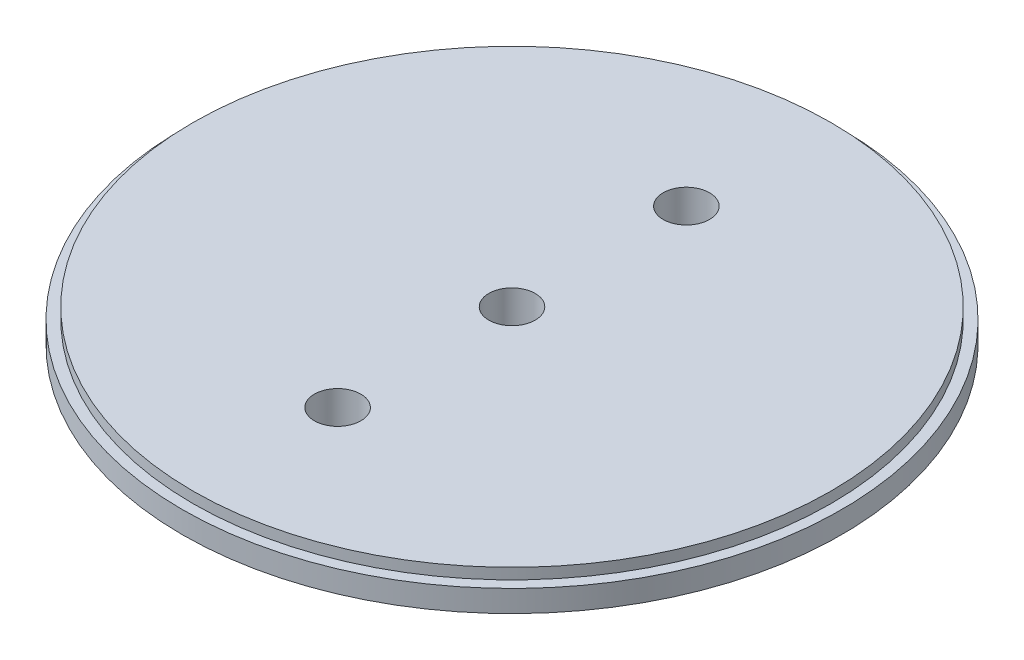
ISO-10303-21;
HEADER;
FILE_DESCRIPTION(('STEP AP214'),'2;1');
FILE_NAME('part.step','',(''),(''),'','','');
FILE_SCHEMA(('AUTOMOTIVE_DESIGN { 1 0 10303 214 1 1 1 1 }'));
ENDSEC;
DATA;
#1=APPLICATION_CONTEXT('core data for automotive mechanical design processes');
#2=APPLICATION_PROTOCOL_DEFINITION('international standard','automotive_design',2000,#1);
#3=PRODUCT_CONTEXT('',#1,'mechanical');
#4=PRODUCT('Part','Part','',(#3));
#5=PRODUCT_RELATED_PRODUCT_CATEGORY('part','',(#4));
#6=PRODUCT_DEFINITION_FORMATION('','',#4);
#7=PRODUCT_DEFINITION_CONTEXT('part definition',#1,'design');
#8=PRODUCT_DEFINITION('design','',#6,#7);
#9=PRODUCT_DEFINITION_SHAPE('','',#8);
#10=(LENGTH_UNIT() NAMED_UNIT(*) SI_UNIT(.MILLI.,.METRE.));
#11=(NAMED_UNIT(*) PLANE_ANGLE_UNIT() SI_UNIT($,.RADIAN.));
#12=(NAMED_UNIT(*) SI_UNIT($,.STERADIAN.) SOLID_ANGLE_UNIT());
#13=UNCERTAINTY_MEASURE_WITH_UNIT(LENGTH_MEASURE(1.E-05),#10,'distance_accuracy_value','');
#14=(GEOMETRIC_REPRESENTATION_CONTEXT(3) GLOBAL_UNCERTAINTY_ASSIGNED_CONTEXT((#13)) GLOBAL_UNIT_ASSIGNED_CONTEXT((#10,
#11,#12)) REPRESENTATION_CONTEXT('',''));
#15=CARTESIAN_POINT('',(0.,0.,0.));
#16=DIRECTION('',(0.,0.,1.));
#17=DIRECTION('',(1.,0.,0.));
#18=AXIS2_PLACEMENT_3D('',#15,#16,#17);
#19=CARTESIAN_POINT('',(0.,1.5875,0.));
#20=DIRECTION('',(0.,-1.,0.));
#21=DIRECTION('',(0.,0.,-1.));
#22=AXIS2_PLACEMENT_3D('',#19,#20,#21);
#23=CYLINDRICAL_SURFACE('',#22,48.006);
#24=CARTESIAN_POINT('',(0.,1.5875,0.));
#25=DIRECTION('',(0.,1.,0.));
#26=DIRECTION('',(0.,0.,1.));
#27=AXIS2_PLACEMENT_3D('',#24,#25,#26);
#28=CIRCLE('',#27,48.006);
#29=CARTESIAN_POINT('',(0.,1.5875,48.006));
#30=VERTEX_POINT('',#29);
#31=EDGE_CURVE('E10',#30,#30,#28,.T.);
#32=ORIENTED_EDGE('',*,*,#31,.F.);
#33=EDGE_LOOP('',(#32));
#34=FACE_BOUND('',#33,.T.);
#35=CARTESIAN_POINT('',(0.,-1.5875,0.));
#36=DIRECTION('',(0.,1.,0.));
#37=DIRECTION('',(0.,0.,1.));
#38=AXIS2_PLACEMENT_3D('',#35,#36,#37);
#39=CIRCLE('',#38,48.006);
#40=CARTESIAN_POINT('',(0.,-1.5875,48.006));
#41=VERTEX_POINT('',#40);
#42=EDGE_CURVE('E47',#41,#41,#39,.T.);
#43=ORIENTED_EDGE('',*,*,#42,.T.);
#44=EDGE_LOOP('',(#43));
#45=FACE_BOUND('',#44,.T.);
#46=ADVANCED_FACE('F40',(#34,#45),#23,.T.);
#47=CARTESIAN_POINT('',(0.,1.5875,0.));
#48=DIRECTION('',(0.,1.,0.));
#49=DIRECTION('',(0.,0.,1.));
#50=AXIS2_PLACEMENT_3D('',#47,#48,#49);
#51=PLANE('',#50);
#52=CARTESIAN_POINT('',(0.,1.5875,0.));
#53=DIRECTION('',(0.,1.,0.));
#54=DIRECTION('',(0.,0.,1.));
#55=AXIS2_PLACEMENT_3D('',#52,#53,#54);
#56=CIRCLE('',#55,46.482);
#57=CARTESIAN_POINT('',(0.,1.5875,46.482));
#58=VERTEX_POINT('',#57);
#59=EDGE_CURVE('E43',#58,#58,#56,.F.);
#60=ORIENTED_EDGE('',*,*,#59,.T.);
#61=EDGE_LOOP('',(#60));
#62=FACE_BOUND('',#61,.T.);
#63=ORIENTED_EDGE('',*,*,#31,.T.);
#64=EDGE_LOOP('',(#63));
#65=FACE_BOUND('',#64,.T.);
#66=ADVANCED_FACE('F81',(#62,#65),#51,.T.);
#67=CARTESIAN_POINT('',(0.,-1.5875,0.));
#68=DIRECTION('',(0.,1.,0.));
#69=DIRECTION('',(0.,0.,1.));
#70=AXIS2_PLACEMENT_3D('',#67,#68,#69);
#71=PLANE('',#70);
#72=CARTESIAN_POINT('',(0.,-1.5875,-25.4));
#73=DIRECTION('',(0.,-1.,0.));
#74=DIRECTION('',(0.,0.,-1.));
#75=AXIS2_PLACEMENT_3D('',#72,#73,#74);
#76=CIRCLE('',#75,3.37819999999999);
#77=CARTESIAN_POINT('',(0.,-1.5875,-28.7782));
#78=VERTEX_POINT('',#77);
#79=EDGE_CURVE('E71',#78,#78,#76,.T.);
#80=ORIENTED_EDGE('',*,*,#79,.F.);
#81=EDGE_LOOP('',(#80));
#82=FACE_BOUND('',#81,.T.);
#83=CARTESIAN_POINT('',(0.,-1.5875,25.4));
#84=DIRECTION('',(0.,-1.,0.));
#85=DIRECTION('',(0.,0.,-1.));
#86=AXIS2_PLACEMENT_3D('',#83,#84,#85);
#87=CIRCLE('',#86,3.37819999999999);
#88=CARTESIAN_POINT('',(0.,-1.5875,22.0218));
#89=VERTEX_POINT('',#88);
#90=EDGE_CURVE('E65',#89,#89,#87,.T.);
#91=ORIENTED_EDGE('',*,*,#90,.F.);
#92=EDGE_LOOP('',(#91));
#93=FACE_BOUND('',#92,.T.);
#94=CARTESIAN_POINT('',(0.,-1.5875,0.));
#95=DIRECTION('',(0.,1.,0.));
#96=DIRECTION('',(0.,0.,1.));
#97=AXIS2_PLACEMENT_3D('',#94,#95,#96);
#98=CIRCLE('',#97,3.37819999999999);
#99=CARTESIAN_POINT('',(0.,-1.5875,3.37819999999999));
#100=VERTEX_POINT('',#99);
#101=EDGE_CURVE('E56',#100,#100,#98,.T.);
#102=ORIENTED_EDGE('',*,*,#101,.T.);
#103=EDGE_LOOP('',(#102));
#104=FACE_BOUND('',#103,.T.);
#105=ORIENTED_EDGE('',*,*,#42,.F.);
#106=EDGE_LOOP('',(#105));
#107=FACE_BOUND('',#106,.T.);
#108=ADVANCED_FACE('F77',(#82,#93,#104,#107),#71,.F.);
#109=CARTESIAN_POINT('',(0.,3.175,0.));
#110=DIRECTION('',(0.,-1.,0.));
#111=DIRECTION('',(0.,0.,-1.));
#112=AXIS2_PLACEMENT_3D('',#109,#110,#111);
#113=CYLINDRICAL_SURFACE('',#112,46.482);
#114=ORIENTED_EDGE('',*,*,#59,.F.);
#115=EDGE_LOOP('',(#114));
#116=FACE_BOUND('',#115,.T.);
#117=CARTESIAN_POINT('',(0.,3.175,0.));
#118=DIRECTION('',(0.,1.,0.));
#119=DIRECTION('',(0.,0.,1.));
#120=AXIS2_PLACEMENT_3D('',#117,#118,#119);
#121=CIRCLE('',#120,46.482);
#122=CARTESIAN_POINT('',(0.,3.175,46.482));
#123=VERTEX_POINT('',#122);
#124=EDGE_CURVE('E53',#123,#123,#121,.T.);
#125=ORIENTED_EDGE('',*,*,#124,.F.);
#126=EDGE_LOOP('',(#125));
#127=FACE_BOUND('',#126,.T.);
#128=ADVANCED_FACE('F80',(#116,#127),#113,.T.);
#129=CARTESIAN_POINT('',(0.,3.175,0.));
#130=DIRECTION('',(0.,1.,0.));
#131=DIRECTION('',(0.,0.,1.));
#132=AXIS2_PLACEMENT_3D('',#129,#130,#131);
#133=PLANE('',#132);
#134=CARTESIAN_POINT('',(0.,3.175,-25.4));
#135=DIRECTION('',(0.,-1.,0.));
#136=DIRECTION('',(0.,0.,-1.));
#137=AXIS2_PLACEMENT_3D('',#134,#135,#136);
#138=CIRCLE('',#137,3.37819999999999);
#139=CARTESIAN_POINT('',(0.,3.175,-28.7782));
#140=VERTEX_POINT('',#139);
#141=EDGE_CURVE('E68',#140,#140,#138,.T.);
#142=ORIENTED_EDGE('',*,*,#141,.T.);
#143=EDGE_LOOP('',(#142));
#144=FACE_BOUND('',#143,.T.);
#145=CARTESIAN_POINT('',(0.,3.175,25.4));
#146=DIRECTION('',(0.,-1.,0.));
#147=DIRECTION('',(0.,0.,-1.));
#148=AXIS2_PLACEMENT_3D('',#145,#146,#147);
#149=CIRCLE('',#148,3.37819999999999);
#150=CARTESIAN_POINT('',(0.,3.175,22.0218));
#151=VERTEX_POINT('',#150);
#152=EDGE_CURVE('E62',#151,#151,#149,.T.);
#153=ORIENTED_EDGE('',*,*,#152,.T.);
#154=EDGE_LOOP('',(#153));
#155=FACE_BOUND('',#154,.T.);
#156=CARTESIAN_POINT('',(0.,3.175,0.));
#157=DIRECTION('',(0.,1.,0.));
#158=DIRECTION('',(0.,0.,1.));
#159=AXIS2_PLACEMENT_3D('',#156,#157,#158);
#160=CIRCLE('',#159,3.37819999999999);
#161=CARTESIAN_POINT('',(0.,3.175,3.37819999999999));
#162=VERTEX_POINT('',#161);
#163=EDGE_CURVE('E59',#162,#162,#160,.T.);
#164=ORIENTED_EDGE('',*,*,#163,.F.);
#165=EDGE_LOOP('',(#164));
#166=FACE_BOUND('',#165,.T.);
#167=ORIENTED_EDGE('',*,*,#124,.T.);
#168=EDGE_LOOP('',(#167));
#169=FACE_BOUND('',#168,.T.);
#170=ADVANCED_FACE('F101',(#144,#155,#166,#169),#133,.T.);
#171=CARTESIAN_POINT('',(0.,3.175,0.));
#172=DIRECTION('',(0.,1.,0.));
#173=DIRECTION('',(0.,0.,1.));
#174=AXIS2_PLACEMENT_3D('',#171,#172,#173);
#175=CYLINDRICAL_SURFACE('',#174,3.37819999999999);
#176=ORIENTED_EDGE('',*,*,#101,.F.);
#177=EDGE_LOOP('',(#176));
#178=FACE_BOUND('',#177,.T.);
#179=ORIENTED_EDGE('',*,*,#163,.T.);
#180=EDGE_LOOP('',(#179));
#181=FACE_BOUND('',#180,.T.);
#182=ADVANCED_FACE('F105',(#178,#181),#175,.F.);
#183=CARTESIAN_POINT('',(0.,-1.5875,25.4));
#184=DIRECTION('',(0.,-1.,0.));
#185=DIRECTION('',(0.,0.,-1.));
#186=AXIS2_PLACEMENT_3D('',#183,#184,#185);
#187=CYLINDRICAL_SURFACE('',#186,3.37819999999999);
#188=ORIENTED_EDGE('',*,*,#152,.F.);
#189=EDGE_LOOP('',(#188));
#190=FACE_BOUND('',#189,.T.);
#191=ORIENTED_EDGE('',*,*,#90,.T.);
#192=EDGE_LOOP('',(#191));
#193=FACE_BOUND('',#192,.T.);
#194=ADVANCED_FACE('F109',(#190,#193),#187,.F.);
#195=CARTESIAN_POINT('',(0.,-1.5875,-25.4));
#196=DIRECTION('',(0.,-1.,0.));
#197=DIRECTION('',(0.,0.,-1.));
#198=AXIS2_PLACEMENT_3D('',#195,#196,#197);
#199=CYLINDRICAL_SURFACE('',#198,3.37819999999999);
#200=ORIENTED_EDGE('',*,*,#141,.F.);
#201=EDGE_LOOP('',(#200));
#202=FACE_BOUND('',#201,.T.);
#203=ORIENTED_EDGE('',*,*,#79,.T.);
#204=EDGE_LOOP('',(#203));
#205=FACE_BOUND('',#204,.T.);
#206=ADVANCED_FACE('F75',(#202,#205),#199,.F.);
#207=CLOSED_SHELL('',(#46,#66,#108,#128,#170,#182,#194,#206));
#208=MANIFOLD_SOLID_BREP('B2',#207);
#209=ADVANCED_BREP_SHAPE_REPRESENTATION('',(#18,#208),#14);
#210=SHAPE_DEFINITION_REPRESENTATION(#9,#209);
ENDSEC;
END-ISO-10303-21;
